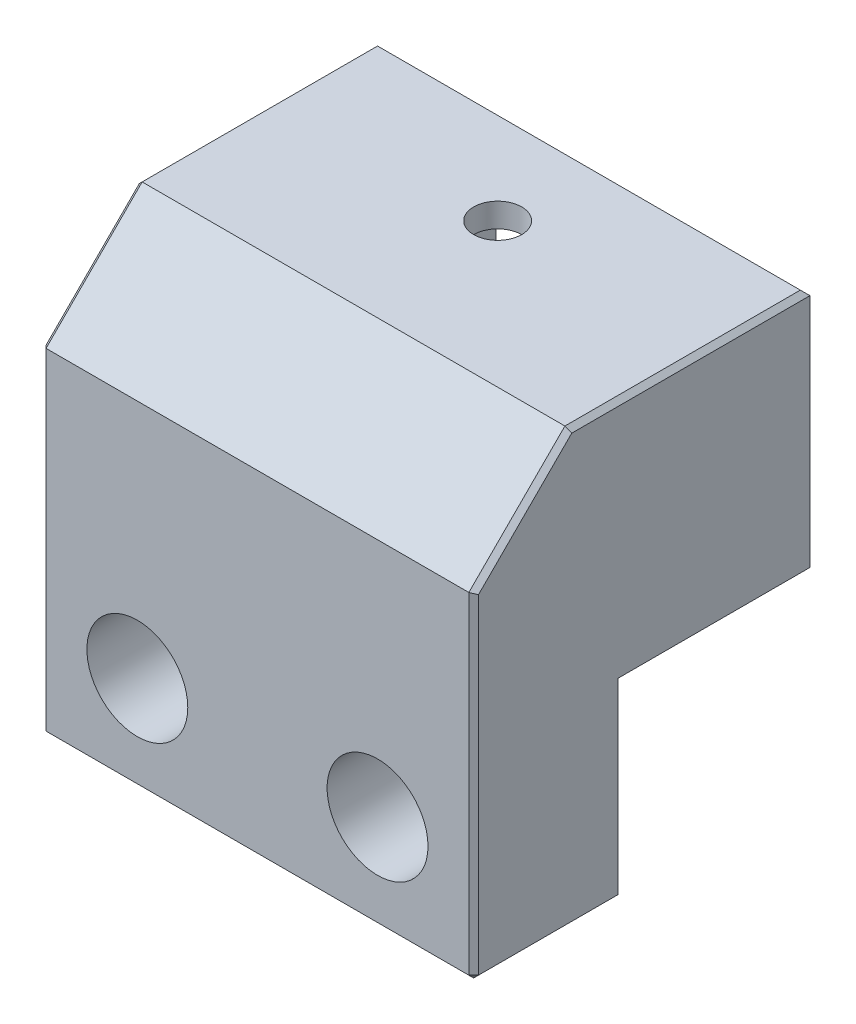
ISO-10303-21;
HEADER;
FILE_DESCRIPTION(('STEP AP214'),'2;1');
FILE_NAME('part.step','',(''),(''),'','','');
FILE_SCHEMA(('AUTOMOTIVE_DESIGN { 1 0 10303 214 1 1 1 1 }'));
ENDSEC;
DATA;
#1=APPLICATION_CONTEXT('core data for automotive mechanical design processes');
#2=APPLICATION_PROTOCOL_DEFINITION('international standard','automotive_design',2000,#1);
#3=PRODUCT_CONTEXT('',#1,'mechanical');
#4=PRODUCT('Part','Part','',(#3));
#5=PRODUCT_RELATED_PRODUCT_CATEGORY('part','',(#4));
#6=PRODUCT_DEFINITION_FORMATION('','',#4);
#7=PRODUCT_DEFINITION_CONTEXT('part definition',#1,'design');
#8=PRODUCT_DEFINITION('design','',#6,#7);
#9=PRODUCT_DEFINITION_SHAPE('','',#8);
#10=(LENGTH_UNIT() NAMED_UNIT(*) SI_UNIT(.MILLI.,.METRE.));
#11=(NAMED_UNIT(*) PLANE_ANGLE_UNIT() SI_UNIT($,.RADIAN.));
#12=(NAMED_UNIT(*) SI_UNIT($,.STERADIAN.) SOLID_ANGLE_UNIT());
#13=UNCERTAINTY_MEASURE_WITH_UNIT(LENGTH_MEASURE(1.E-05),#10,'distance_accuracy_value','');
#14=(GEOMETRIC_REPRESENTATION_CONTEXT(3) GLOBAL_UNCERTAINTY_ASSIGNED_CONTEXT((#13)) GLOBAL_UNIT_ASSIGNED_CONTEXT((#10,
#11,#12)) REPRESENTATION_CONTEXT('',''));
#15=CARTESIAN_POINT('',(0.,0.,0.));
#16=DIRECTION('',(0.,0.,1.));
#17=DIRECTION('',(1.,0.,0.));
#18=AXIS2_PLACEMENT_3D('',#15,#16,#17);
#19=CARTESIAN_POINT('',(0.,25.,0.));
#20=DIRECTION('',(0.,-1.,0.));
#21=DIRECTION('',(0.,0.,-1.));
#22=AXIS2_PLACEMENT_3D('',#19,#20,#21);
#23=CYLINDRICAL_SURFACE('',#22,2.5);
#24=CARTESIAN_POINT('',(0.,25.,0.));
#25=DIRECTION('',(0.,1.,0.));
#26=DIRECTION('',(0.,0.,1.));
#27=AXIS2_PLACEMENT_3D('',#24,#25,#26);
#28=CIRCLE('',#27,2.5);
#29=CARTESIAN_POINT('',(0.,25.,2.5));
#30=VERTEX_POINT('',#29);
#31=EDGE_CURVE('E210',#30,#30,#28,.T.);
#32=ORIENTED_EDGE('',*,*,#31,.T.);
#33=EDGE_LOOP('',(#32));
#34=FACE_BOUND('',#33,.T.);
#35=CARTESIAN_POINT('',(0.,22.5,0.));
#36=DIRECTION('',(0.,-1.,0.));
#37=DIRECTION('',(0.,0.,-1.));
#38=AXIS2_PLACEMENT_3D('',#35,#36,#37);
#39=CIRCLE('',#38,2.5);
#40=CARTESIAN_POINT('',(0.,22.5,-2.5));
#41=VERTEX_POINT('',#40);
#42=EDGE_CURVE('E195',#41,#41,#39,.T.);
#43=ORIENTED_EDGE('',*,*,#42,.T.);
#44=EDGE_LOOP('',(#43));
#45=FACE_BOUND('',#44,.T.);
#46=ADVANCED_FACE('F33',(#34,#45),#23,.F.);
#47=CARTESIAN_POINT('',(0.,25.,0.));
#48=DIRECTION('',(0.,1.,0.));
#49=DIRECTION('',(0.,0.,1.));
#50=AXIS2_PLACEMENT_3D('',#47,#48,#49);
#51=PLANE('',#50);
#52=DIRECTION('',(1.,0.,0.));
#53=VECTOR('',#52,1.);
#54=CARTESIAN_POINT('',(0.,25.,15.));
#55=LINE('',#54,#53);
#56=CARTESIAN_POINT('',(-22.,25.,15.));
#57=VERTEX_POINT('',#56);
#58=CARTESIAN_POINT('',(22.,25.,15.));
#59=VERTEX_POINT('',#58);
#60=EDGE_CURVE('E236',#57,#59,#55,.T.);
#61=ORIENTED_EDGE('',*,*,#60,.T.);
#62=DIRECTION('',(0.,0.,-1.));
#63=VECTOR('',#62,1.);
#64=CARTESIAN_POINT('',(22.,25.,-10.));
#65=LINE('',#64,#63);
#66=CARTESIAN_POINT('',(22.,25.,-9.50000000000001));
#67=VERTEX_POINT('',#66);
#68=EDGE_CURVE('E282',#59,#67,#65,.T.);
#69=ORIENTED_EDGE('',*,*,#68,.T.);
#70=DIRECTION('',(-1.,0.,0.));
#71=VECTOR('',#70,1.);
#72=CARTESIAN_POINT('',(-22.5,25.,-9.50000000000001));
#73=LINE('',#72,#71);
#74=CARTESIAN_POINT('',(-22.,25.,-9.50000000000001));
#75=VERTEX_POINT('',#74);
#76=EDGE_CURVE('E280',#67,#75,#73,.T.);
#77=ORIENTED_EDGE('',*,*,#76,.T.);
#78=DIRECTION('',(0.,0.,1.));
#79=VECTOR('',#78,1.);
#80=CARTESIAN_POINT('',(-22.,25.,15.));
#81=LINE('',#80,#79);
#82=EDGE_CURVE('E278',#75,#57,#81,.T.);
#83=ORIENTED_EDGE('',*,*,#82,.T.);
#84=EDGE_LOOP('',(#61,#69,#77,#83));
#85=FACE_BOUND('',#84,.T.);
#86=ORIENTED_EDGE('',*,*,#31,.F.);
#87=EDGE_LOOP('',(#86));
#88=FACE_BOUND('',#87,.T.);
#89=ADVANCED_FACE('F363',(#85,#88),#51,.T.);
#90=CARTESIAN_POINT('',(0.,0.,0.));
#91=DIRECTION('',(0.,1.,0.));
#92=DIRECTION('',(0.,0.,1.));
#93=AXIS2_PLACEMENT_3D('',#90,#91,#92);
#94=PLANE('',#93);
#95=DIRECTION('',(0.,0.,-1.));
#96=VECTOR('',#95,1.);
#97=CARTESIAN_POINT('',(22.5,0.,-10.));
#98=LINE('',#97,#96);
#99=CARTESIAN_POINT('',(22.5,0.,10.));
#100=VERTEX_POINT('',#99);
#101=CARTESIAN_POINT('',(22.5,0.,-10.));
#102=VERTEX_POINT('',#101);
#103=EDGE_CURVE('E213',#100,#102,#98,.T.);
#104=ORIENTED_EDGE('',*,*,#103,.F.);
#105=DIRECTION('',(1.,0.,0.));
#106=VECTOR('',#105,1.);
#107=CARTESIAN_POINT('',(-22.5,0.,10.));
#108=LINE('',#107,#106);
#109=CARTESIAN_POINT('',(-22.5,0.,10.));
#110=VERTEX_POINT('',#109);
#111=EDGE_CURVE('E223',#110,#100,#108,.T.);
#112=ORIENTED_EDGE('',*,*,#111,.F.);
#113=DIRECTION('',(0.,0.,1.));
#114=VECTOR('',#113,1.);
#115=CARTESIAN_POINT('',(-22.5,0.,-10.));
#116=LINE('',#115,#114);
#117=CARTESIAN_POINT('',(-22.5,0.,-10.));
#118=VERTEX_POINT('',#117);
#119=EDGE_CURVE('E221',#118,#110,#116,.T.);
#120=ORIENTED_EDGE('',*,*,#119,.F.);
#121=DIRECTION('',(-1.,0.,0.));
#122=VECTOR('',#121,1.);
#123=CARTESIAN_POINT('',(-22.5,0.,-10.));
#124=LINE('',#123,#122);
#125=EDGE_CURVE('E218',#102,#118,#124,.T.);
#126=ORIENTED_EDGE('',*,*,#125,.F.);
#127=EDGE_LOOP('',(#104,#112,#120,#126));
#128=FACE_BOUND('',#127,.T.);
#129=CARTESIAN_POINT('',(0.,0.,0.));
#130=DIRECTION('',(0.,1.,0.));
#131=DIRECTION('',(0.,0.,1.));
#132=AXIS2_PLACEMENT_3D('',#129,#130,#131);
#133=CIRCLE('',#132,2.5);
#134=CARTESIAN_POINT('',(0.,0.,2.5));
#135=VERTEX_POINT('',#134);
#136=EDGE_CURVE('E209',#135,#135,#133,.T.);
#137=ORIENTED_EDGE('',*,*,#136,.T.);
#138=EDGE_LOOP('',(#137));
#139=FACE_BOUND('',#138,.T.);
#140=ADVANCED_FACE('F370',(#128,#139),#94,.F.);
#141=CARTESIAN_POINT('',(22.5,25.,-10.));
#142=DIRECTION('',(-1.,0.,0.));
#143=DIRECTION('',(0.,0.,1.));
#144=AXIS2_PLACEMENT_3D('',#141,#142,#143);
#145=PLANE('',#144);
#146=DIRECTION('',(0.,-1.,0.));
#147=VECTOR('',#146,1.);
#148=CARTESIAN_POINT('',(22.5,25.,-10.));
#149=LINE('',#148,#147);
#150=CARTESIAN_POINT('',(22.5,24.5,-10.));
#151=VERTEX_POINT('',#150);
#152=EDGE_CURVE('E228',#151,#102,#149,.T.);
#153=ORIENTED_EDGE('',*,*,#152,.F.);
#154=DIRECTION('',(0.,0.,1.));
#155=VECTOR('',#154,1.);
#156=CARTESIAN_POINT('',(22.5,24.5,15.));
#157=LINE('',#156,#155);
#158=CARTESIAN_POINT('',(22.5,24.5,14.7928932188134));
#159=VERTEX_POINT('',#158);
#160=EDGE_CURVE('E253',#151,#159,#157,.T.);
#161=ORIENTED_EDGE('',*,*,#160,.T.);
#162=DIRECTION('',(0.,-0.707106781186546,0.707106781186549));
#163=VECTOR('',#162,1.);
#164=CARTESIAN_POINT('',(22.5,14.6464466094067,24.6464466094067));
#165=LINE('',#164,#163);
#166=CARTESIAN_POINT('',(22.5,14.7928932188135,24.5));
#167=VERTEX_POINT('',#166);
#168=EDGE_CURVE('E248',#159,#167,#165,.T.);
#169=ORIENTED_EDGE('',*,*,#168,.T.);
#170=DIRECTION('',(0.,-1.,0.));
#171=VECTOR('',#170,1.);
#172=CARTESIAN_POINT('',(22.5,-20.,24.5));
#173=LINE('',#172,#171);
#174=CARTESIAN_POINT('',(22.5,-19.5,24.5));
#175=VERTEX_POINT('',#174);
#176=EDGE_CURVE('E239',#167,#175,#173,.T.);
#177=ORIENTED_EDGE('',*,*,#176,.T.);
#178=DIRECTION('',(0.,0.,-1.));
#179=VECTOR('',#178,1.);
#180=CARTESIAN_POINT('',(22.5,-19.5,-10.));
#181=LINE('',#180,#179);
#182=CARTESIAN_POINT('',(22.5,-19.5,10.));
#183=VERTEX_POINT('',#182);
#184=EDGE_CURVE('E250',#175,#183,#181,.T.);
#185=ORIENTED_EDGE('',*,*,#184,.T.);
#186=DIRECTION('',(0.,1.,0.));
#187=VECTOR('',#186,1.);
#188=CARTESIAN_POINT('',(22.5,25.,10.));
#189=LINE('',#188,#187);
#190=EDGE_CURVE('E207',#183,#100,#189,.T.);
#191=ORIENTED_EDGE('',*,*,#190,.T.);
#192=ORIENTED_EDGE('',*,*,#103,.T.);
#193=EDGE_LOOP('',(#153,#161,#169,#177,#185,#191,#192));
#194=FACE_BOUND('',#193,.T.);
#195=ADVANCED_FACE('F394',(#194),#145,.F.);
#196=CARTESIAN_POINT('',(-22.5,25.,-10.));
#197=DIRECTION('',(0.,0.,1.));
#198=DIRECTION('',(1.,0.,0.));
#199=AXIS2_PLACEMENT_3D('',#196,#197,#198);
#200=PLANE('',#199);
#201=DIRECTION('',(0.,1.,0.));
#202=VECTOR('',#201,1.);
#203=CARTESIAN_POINT('',(-10.16,3.,-10.));
#204=LINE('',#203,#202);
#205=CARTESIAN_POINT('',(-10.16,3.,-10.));
#206=VERTEX_POINT('',#205);
#207=CARTESIAN_POINT('',(-10.16,22.5,-10.));
#208=VERTEX_POINT('',#207);
#209=EDGE_CURVE('E196',#206,#208,#204,.T.);
#210=ORIENTED_EDGE('',*,*,#209,.F.);
#211=DIRECTION('',(-1.,0.,0.));
#212=VECTOR('',#211,1.);
#213=CARTESIAN_POINT('',(10.16,3.,-10.));
#214=LINE('',#213,#212);
#215=CARTESIAN_POINT('',(10.16,3.,-10.));
#216=VERTEX_POINT('',#215);
#217=EDGE_CURVE('E172',#216,#206,#214,.T.);
#218=ORIENTED_EDGE('',*,*,#217,.F.);
#219=DIRECTION('',(0.,1.,0.));
#220=VECTOR('',#219,1.);
#221=CARTESIAN_POINT('',(10.16,3.,-10.));
#222=LINE('',#221,#220);
#223=CARTESIAN_POINT('',(10.16,22.5,-10.));
#224=VERTEX_POINT('',#223);
#225=EDGE_CURVE('E163',#216,#224,#222,.T.);
#226=ORIENTED_EDGE('',*,*,#225,.T.);
#227=DIRECTION('',(-1.,0.,0.));
#228=VECTOR('',#227,1.);
#229=CARTESIAN_POINT('',(10.16,22.5,-10.));
#230=LINE('',#229,#228);
#231=EDGE_CURVE('E179',#224,#208,#230,.T.);
#232=ORIENTED_EDGE('',*,*,#231,.T.);
#233=EDGE_LOOP('',(#210,#218,#226,#232));
#234=FACE_BOUND('',#233,.T.);
#235=DIRECTION('',(0.,-1.,0.));
#236=VECTOR('',#235,1.);
#237=CARTESIAN_POINT('',(-22.5,25.,-10.));
#238=LINE('',#237,#236);
#239=CARTESIAN_POINT('',(-22.5,24.5,-10.));
#240=VERTEX_POINT('',#239);
#241=EDGE_CURVE('E226',#240,#118,#238,.T.);
#242=ORIENTED_EDGE('',*,*,#241,.F.);
#243=DIRECTION('',(1.,0.,0.));
#244=VECTOR('',#243,1.);
#245=CARTESIAN_POINT('',(22.5,24.5,-10.));
#246=LINE('',#245,#244);
#247=EDGE_CURVE('E284',#240,#151,#246,.T.);
#248=ORIENTED_EDGE('',*,*,#247,.T.);
#249=ORIENTED_EDGE('',*,*,#152,.T.);
#250=ORIENTED_EDGE('',*,*,#125,.T.);
#251=EDGE_LOOP('',(#242,#248,#249,#250));
#252=FACE_BOUND('',#251,.T.);
#253=ADVANCED_FACE('F386',(#234,#252),#200,.F.);
#254=CARTESIAN_POINT('',(-22.5,25.,-10.));
#255=DIRECTION('',(1.,0.,0.));
#256=DIRECTION('',(0.,0.,-1.));
#257=AXIS2_PLACEMENT_3D('',#254,#255,#256);
#258=PLANE('',#257);
#259=DIRECTION('',(0.,-1.,0.));
#260=VECTOR('',#259,1.);
#261=CARTESIAN_POINT('',(-22.5,25.,10.));
#262=LINE('',#261,#260);
#263=CARTESIAN_POINT('',(-22.5,-19.5,10.));
#264=VERTEX_POINT('',#263);
#265=EDGE_CURVE('E200',#110,#264,#262,.T.);
#266=ORIENTED_EDGE('',*,*,#265,.T.);
#267=DIRECTION('',(0.,0.,1.));
#268=VECTOR('',#267,1.);
#269=CARTESIAN_POINT('',(-22.5,-19.5,-10.));
#270=LINE('',#269,#268);
#271=CARTESIAN_POINT('',(-22.5,-19.5,24.5));
#272=VERTEX_POINT('',#271);
#273=EDGE_CURVE('E271',#264,#272,#270,.T.);
#274=ORIENTED_EDGE('',*,*,#273,.T.);
#275=DIRECTION('',(0.,1.,0.));
#276=VECTOR('',#275,1.);
#277=CARTESIAN_POINT('',(-22.5,15.,24.5));
#278=LINE('',#277,#276);
#279=CARTESIAN_POINT('',(-22.5,14.7928932188134,24.5));
#280=VERTEX_POINT('',#279);
#281=EDGE_CURVE('E265',#272,#280,#278,.T.);
#282=ORIENTED_EDGE('',*,*,#281,.T.);
#283=DIRECTION('',(0.,0.707106781186546,-0.707106781186549));
#284=VECTOR('',#283,1.);
#285=CARTESIAN_POINT('',(-22.5,24.6464466094067,14.6464466094067));
#286=LINE('',#285,#284);
#287=CARTESIAN_POINT('',(-22.5,24.5,14.7928932188134));
#288=VERTEX_POINT('',#287);
#289=EDGE_CURVE('E267',#280,#288,#286,.T.);
#290=ORIENTED_EDGE('',*,*,#289,.T.);
#291=DIRECTION('',(0.,0.,-1.));
#292=VECTOR('',#291,1.);
#293=CARTESIAN_POINT('',(-22.5,24.5,-10.));
#294=LINE('',#293,#292);
#295=EDGE_CURVE('E269',#288,#240,#294,.T.);
#296=ORIENTED_EDGE('',*,*,#295,.T.);
#297=ORIENTED_EDGE('',*,*,#241,.T.);
#298=ORIENTED_EDGE('',*,*,#119,.T.);
#299=EDGE_LOOP('',(#266,#274,#282,#290,#296,#297,#298));
#300=FACE_BOUND('',#299,.T.);
#301=ADVANCED_FACE('F377',(#300),#258,.F.);
#302=CARTESIAN_POINT('',(0.,3.,0.));
#303=DIRECTION('',(0.,-1.,0.));
#304=DIRECTION('',(0.,0.,-1.));
#305=AXIS2_PLACEMENT_3D('',#302,#303,#304);
#306=CIRCLE('',#305,2.5);
#307=CARTESIAN_POINT('',(0.,3.,-2.5));
#308=VERTEX_POINT('',#307);
#309=EDGE_CURVE('E204',#308,#308,#306,.T.);
#310=ORIENTED_EDGE('',*,*,#309,.F.);
#311=EDGE_LOOP('',(#310));
#312=FACE_BOUND('',#311,.T.);
#313=ORIENTED_EDGE('',*,*,#136,.F.);
#314=EDGE_LOOP('',(#313));
#315=FACE_BOUND('',#314,.T.);
#316=ADVANCED_FACE('F366',(#312,#315),#23,.F.);
#317=CARTESIAN_POINT('',(0.,0.,10.));
#318=DIRECTION('',(0.,0.,1.));
#319=DIRECTION('',(1.,0.,0.));
#320=AXIS2_PLACEMENT_3D('',#317,#318,#319);
#321=PLANE('',#320);
#322=CARTESIAN_POINT('',(-12.5,-10.,10.));
#323=DIRECTION('',(0.,0.,1.));
#324=DIRECTION('',(1.,0.,0.));
#325=AXIS2_PLACEMENT_3D('',#322,#323,#324);
#326=CIRCLE('',#325,2.74999999999999);
#327=CARTESIAN_POINT('',(-9.75000000000001,-10.,10.));
#328=VERTEX_POINT('',#327);
#329=EDGE_CURVE('E242',#328,#328,#326,.T.);
#330=ORIENTED_EDGE('',*,*,#329,.T.);
#331=EDGE_LOOP('',(#330));
#332=FACE_BOUND('',#331,.T.);
#333=CARTESIAN_POINT('',(12.5,-10.,10.));
#334=DIRECTION('',(0.,0.,1.));
#335=DIRECTION('',(1.,0.,0.));
#336=AXIS2_PLACEMENT_3D('',#333,#334,#335);
#337=CIRCLE('',#336,2.74999999999999);
#338=CARTESIAN_POINT('',(15.25,-10.,10.));
#339=VERTEX_POINT('',#338);
#340=EDGE_CURVE('E189',#339,#339,#337,.T.);
#341=ORIENTED_EDGE('',*,*,#340,.T.);
#342=EDGE_LOOP('',(#341));
#343=FACE_BOUND('',#342,.T.);
#344=ORIENTED_EDGE('',*,*,#190,.F.);
#345=DIRECTION('',(0.707106781186556,0.707106781186539,0.));
#346=VECTOR('',#345,1.);
#347=CARTESIAN_POINT('',(22.5,-19.5,10.));
#348=LINE('',#347,#346);
#349=CARTESIAN_POINT('',(22.,-20.,10.));
#350=VERTEX_POINT('',#349);
#351=EDGE_CURVE('E257',#183,#350,#348,.F.);
#352=ORIENTED_EDGE('',*,*,#351,.T.);
#353=DIRECTION('',(1.,0.,0.));
#354=VECTOR('',#353,1.);
#355=CARTESIAN_POINT('',(-22.5,-20.,10.));
#356=LINE('',#355,#354);
#357=CARTESIAN_POINT('',(-22.,-20.,10.));
#358=VERTEX_POINT('',#357);
#359=EDGE_CURVE('E203',#358,#350,#356,.T.);
#360=ORIENTED_EDGE('',*,*,#359,.F.);
#361=DIRECTION('',(0.70710678118654,-0.707106781186555,0.));
#362=VECTOR('',#361,1.);
#363=CARTESIAN_POINT('',(-22.,-20.,10.));
#364=LINE('',#363,#362);
#365=EDGE_CURVE('E255',#358,#264,#364,.F.);
#366=ORIENTED_EDGE('',*,*,#365,.T.);
#367=ORIENTED_EDGE('',*,*,#265,.F.);
#368=ORIENTED_EDGE('',*,*,#111,.T.);
#369=EDGE_LOOP('',(#344,#352,#360,#366,#367,#368));
#370=FACE_BOUND('',#369,.T.);
#371=ADVANCED_FACE('F376',(#332,#343,#370),#321,.F.);
#372=CARTESIAN_POINT('',(-22.5,-20.,25.));
#373=DIRECTION('',(0.,1.,0.));
#374=DIRECTION('',(-1.,0.,0.));
#375=AXIS2_PLACEMENT_3D('',#372,#373,#374);
#376=PLANE('',#375);
#377=ORIENTED_EDGE('',*,*,#359,.T.);
#378=DIRECTION('',(0.,0.,1.));
#379=VECTOR('',#378,1.);
#380=CARTESIAN_POINT('',(22.,-20.,25.));
#381=LINE('',#380,#379);
#382=CARTESIAN_POINT('',(22.,-20.,24.5));
#383=VERTEX_POINT('',#382);
#384=EDGE_CURVE('E263',#350,#383,#381,.T.);
#385=ORIENTED_EDGE('',*,*,#384,.T.);
#386=DIRECTION('',(-1.,0.,0.));
#387=VECTOR('',#386,1.);
#388=CARTESIAN_POINT('',(-22.5,-20.,24.5));
#389=LINE('',#388,#387);
#390=CARTESIAN_POINT('',(-22.,-20.,24.5));
#391=VERTEX_POINT('',#390);
#392=EDGE_CURVE('E259',#383,#391,#389,.T.);
#393=ORIENTED_EDGE('',*,*,#392,.T.);
#394=DIRECTION('',(0.,0.,-1.));
#395=VECTOR('',#394,1.);
#396=CARTESIAN_POINT('',(-22.,-20.,25.));
#397=LINE('',#396,#395);
#398=EDGE_CURVE('E261',#391,#358,#397,.T.);
#399=ORIENTED_EDGE('',*,*,#398,.T.);
#400=EDGE_LOOP('',(#377,#385,#393,#399));
#401=FACE_BOUND('',#400,.T.);
#402=ADVANCED_FACE('F383',(#401),#376,.F.);
#403=CARTESIAN_POINT('',(0.,0.,25.));
#404=DIRECTION('',(0.,0.,1.));
#405=DIRECTION('',(1.,0.,0.));
#406=AXIS2_PLACEMENT_3D('',#403,#404,#405);
#407=PLANE('',#406);
#408=CARTESIAN_POINT('',(-12.5,-10.,25.));
#409=DIRECTION('',(0.,0.,1.));
#410=DIRECTION('',(1.,0.,0.));
#411=AXIS2_PLACEMENT_3D('',#408,#409,#410);
#412=CIRCLE('',#411,5.25);
#413=CARTESIAN_POINT('',(-7.25,-10.,25.));
#414=VERTEX_POINT('',#413);
#415=EDGE_CURVE('E323',#414,#414,#412,.T.);
#416=ORIENTED_EDGE('',*,*,#415,.F.);
#417=EDGE_LOOP('',(#416));
#418=FACE_BOUND('',#417,.T.);
#419=CARTESIAN_POINT('',(12.5,-10.,25.));
#420=DIRECTION('',(0.,0.,1.));
#421=DIRECTION('',(1.,0.,0.));
#422=AXIS2_PLACEMENT_3D('',#419,#420,#421);
#423=CIRCLE('',#422,5.25);
#424=CARTESIAN_POINT('',(17.75,-10.,25.));
#425=VERTEX_POINT('',#424);
#426=EDGE_CURVE('E245',#425,#425,#423,.T.);
#427=ORIENTED_EDGE('',*,*,#426,.F.);
#428=EDGE_LOOP('',(#427));
#429=FACE_BOUND('',#428,.T.);
#430=DIRECTION('',(1.,0.,0.));
#431=VECTOR('',#430,1.);
#432=CARTESIAN_POINT('',(22.5,-19.5,25.));
#433=LINE('',#432,#431);
#434=CARTESIAN_POINT('',(-22.,-19.5,25.));
#435=VERTEX_POINT('',#434);
#436=CARTESIAN_POINT('',(22.,-19.5,25.));
#437=VERTEX_POINT('',#436);
#438=EDGE_CURVE('E42',#435,#437,#433,.T.);
#439=ORIENTED_EDGE('',*,*,#438,.T.);
#440=DIRECTION('',(0.,1.,0.));
#441=VECTOR('',#440,1.);
#442=CARTESIAN_POINT('',(22.,15.,25.));
#443=LINE('',#442,#441);
#444=CARTESIAN_POINT('',(22.,15.,25.));
#445=VERTEX_POINT('',#444);
#446=EDGE_CURVE('E11',#437,#445,#443,.T.);
#447=ORIENTED_EDGE('',*,*,#446,.T.);
#448=DIRECTION('',(-1.,0.,0.));
#449=VECTOR('',#448,1.);
#450=CARTESIAN_POINT('',(0.,15.,25.));
#451=LINE('',#450,#449);
#452=CARTESIAN_POINT('',(-22.,15.,25.));
#453=VERTEX_POINT('',#452);
#454=EDGE_CURVE('E230',#445,#453,#451,.T.);
#455=ORIENTED_EDGE('',*,*,#454,.T.);
#456=DIRECTION('',(0.,-1.,0.));
#457=VECTOR('',#456,1.);
#458=CARTESIAN_POINT('',(-22.,-20.,25.));
#459=LINE('',#458,#457);
#460=EDGE_CURVE('E53',#453,#435,#459,.T.);
#461=ORIENTED_EDGE('',*,*,#460,.T.);
#462=EDGE_LOOP('',(#439,#447,#455,#461));
#463=FACE_BOUND('',#462,.T.);
#464=ADVANCED_FACE('F487',(#418,#429,#463),#407,.T.);
#465=CARTESIAN_POINT('',(0.,3.,0.));
#466=DIRECTION('',(0.,1.,0.));
#467=DIRECTION('',(0.,0.,1.));
#468=AXIS2_PLACEMENT_3D('',#465,#466,#467);
#469=CYLINDRICAL_SURFACE('',#468,10.16);
#470=CARTESIAN_POINT('',(0.,22.5,0.));
#471=DIRECTION('',(0.,1.,0.));
#472=DIRECTION('',(0.,0.,-1.));
#473=AXIS2_PLACEMENT_3D('',#470,#471,#472);
#474=CIRCLE('',#473,10.16);
#475=CARTESIAN_POINT('',(-10.16,22.5,0.));
#476=VERTEX_POINT('',#475);
#477=CARTESIAN_POINT('',(10.16,22.5,0.));
#478=VERTEX_POINT('',#477);
#479=EDGE_CURVE('E159',#476,#478,#474,.T.);
#480=ORIENTED_EDGE('',*,*,#479,.T.);
#481=DIRECTION('',(0.,1.,0.));
#482=VECTOR('',#481,1.);
#483=CARTESIAN_POINT('',(10.16,3.,0.));
#484=LINE('',#483,#482);
#485=CARTESIAN_POINT('',(10.16,3.,0.));
#486=VERTEX_POINT('',#485);
#487=EDGE_CURVE('E152',#486,#478,#484,.T.);
#488=ORIENTED_EDGE('',*,*,#487,.F.);
#489=CARTESIAN_POINT('',(0.,3.,0.));
#490=DIRECTION('',(0.,1.,0.));
#491=DIRECTION('',(0.,0.,-1.));
#492=AXIS2_PLACEMENT_3D('',#489,#490,#491);
#493=CIRCLE('',#492,10.16);
#494=CARTESIAN_POINT('',(-10.16,3.,0.));
#495=VERTEX_POINT('',#494);
#496=EDGE_CURVE('E156',#495,#486,#493,.T.);
#497=ORIENTED_EDGE('',*,*,#496,.F.);
#498=DIRECTION('',(0.,1.,0.));
#499=VECTOR('',#498,1.);
#500=CARTESIAN_POINT('',(-10.16,3.,0.));
#501=LINE('',#500,#499);
#502=EDGE_CURVE('E193',#495,#476,#501,.T.);
#503=ORIENTED_EDGE('',*,*,#502,.T.);
#504=EDGE_LOOP('',(#480,#488,#497,#503));
#505=FACE_BOUND('',#504,.T.);
#506=ADVANCED_FACE('F154',(#505),#469,.F.);
#507=CARTESIAN_POINT('',(-10.16,3.,-10.));
#508=DIRECTION('',(-1.,0.,0.));
#509=DIRECTION('',(0.,0.,1.));
#510=AXIS2_PLACEMENT_3D('',#507,#508,#509);
#511=PLANE('',#510);
#512=DIRECTION('',(0.,0.,1.));
#513=VECTOR('',#512,1.);
#514=CARTESIAN_POINT('',(-10.16,22.5,-10.));
#515=LINE('',#514,#513);
#516=EDGE_CURVE('E176',#208,#476,#515,.T.);
#517=ORIENTED_EDGE('',*,*,#516,.T.);
#518=ORIENTED_EDGE('',*,*,#502,.F.);
#519=DIRECTION('',(0.,0.,1.));
#520=VECTOR('',#519,1.);
#521=CARTESIAN_POINT('',(-10.16,3.,-10.));
#522=LINE('',#521,#520);
#523=EDGE_CURVE('E164',#206,#495,#522,.T.);
#524=ORIENTED_EDGE('',*,*,#523,.F.);
#525=ORIENTED_EDGE('',*,*,#209,.T.);
#526=EDGE_LOOP('',(#517,#518,#524,#525));
#527=FACE_BOUND('',#526,.T.);
#528=ADVANCED_FACE('F510',(#527),#511,.F.);
#529=CARTESIAN_POINT('',(10.16,3.,0.));
#530=DIRECTION('',(1.,0.,0.));
#531=DIRECTION('',(0.,0.,-1.));
#532=AXIS2_PLACEMENT_3D('',#529,#530,#531);
#533=PLANE('',#532);
#534=DIRECTION('',(0.,0.,-1.));
#535=VECTOR('',#534,1.);
#536=CARTESIAN_POINT('',(10.16,22.5,0.));
#537=LINE('',#536,#535);
#538=EDGE_CURVE('E188',#478,#224,#537,.T.);
#539=ORIENTED_EDGE('',*,*,#538,.T.);
#540=ORIENTED_EDGE('',*,*,#225,.F.);
#541=DIRECTION('',(0.,0.,-1.));
#542=VECTOR('',#541,1.);
#543=CARTESIAN_POINT('',(10.16,3.,0.));
#544=LINE('',#543,#542);
#545=EDGE_CURVE('E167',#486,#216,#544,.T.);
#546=ORIENTED_EDGE('',*,*,#545,.F.);
#547=ORIENTED_EDGE('',*,*,#487,.T.);
#548=EDGE_LOOP('',(#539,#540,#546,#547));
#549=FACE_BOUND('',#548,.T.);
#550=ADVANCED_FACE('F168',(#549),#533,.F.);
#551=CARTESIAN_POINT('',(0.,3.,0.));
#552=DIRECTION('',(0.,-1.,0.));
#553=DIRECTION('',(0.,0.,-1.));
#554=AXIS2_PLACEMENT_3D('',#551,#552,#553);
#555=PLANE('',#554);
#556=ORIENTED_EDGE('',*,*,#309,.T.);
#557=EDGE_LOOP('',(#556));
#558=FACE_BOUND('',#557,.T.);
#559=ORIENTED_EDGE('',*,*,#496,.T.);
#560=ORIENTED_EDGE('',*,*,#545,.T.);
#561=ORIENTED_EDGE('',*,*,#217,.T.);
#562=ORIENTED_EDGE('',*,*,#523,.T.);
#563=EDGE_LOOP('',(#559,#560,#561,#562));
#564=FACE_BOUND('',#563,.T.);
#565=ADVANCED_FACE('F174',(#558,#564),#555,.F.);
#566=CARTESIAN_POINT('',(0.,22.5,0.));
#567=DIRECTION('',(0.,-1.,0.));
#568=DIRECTION('',(0.,0.,-1.));
#569=AXIS2_PLACEMENT_3D('',#566,#567,#568);
#570=PLANE('',#569);
#571=ORIENTED_EDGE('',*,*,#42,.F.);
#572=EDGE_LOOP('',(#571));
#573=FACE_BOUND('',#572,.T.);
#574=ORIENTED_EDGE('',*,*,#479,.F.);
#575=ORIENTED_EDGE('',*,*,#516,.F.);
#576=ORIENTED_EDGE('',*,*,#231,.F.);
#577=ORIENTED_EDGE('',*,*,#538,.F.);
#578=EDGE_LOOP('',(#574,#575,#576,#577));
#579=FACE_BOUND('',#578,.T.);
#580=ADVANCED_FACE('F409',(#573,#579),#570,.T.);
#581=CARTESIAN_POINT('',(0.,15.,25.));
#582=DIRECTION('',(0.,-0.707106781186549,-0.707106781186546));
#583=DIRECTION('',(-1.,0.,0.));
#584=AXIS2_PLACEMENT_3D('',#581,#582,#583);
#585=PLANE('',#584);
#586=ORIENTED_EDGE('',*,*,#454,.F.);
#587=DIRECTION('',(0.,-0.707106781186546,0.707106781186549));
#588=VECTOR('',#587,1.);
#589=CARTESIAN_POINT('',(22.,25.,15.));
#590=LINE('',#589,#588);
#591=EDGE_CURVE('E275',#445,#59,#590,.F.);
#592=ORIENTED_EDGE('',*,*,#591,.T.);
#593=ORIENTED_EDGE('',*,*,#60,.F.);
#594=DIRECTION('',(0.,0.707106781186546,-0.707106781186549));
#595=VECTOR('',#594,1.);
#596=CARTESIAN_POINT('',(-22.,15.,25.));
#597=LINE('',#596,#595);
#598=EDGE_CURVE('E273',#57,#453,#597,.F.);
#599=ORIENTED_EDGE('',*,*,#598,.T.);
#600=EDGE_LOOP('',(#586,#592,#593,#599));
#601=FACE_BOUND('',#600,.T.);
#602=ADVANCED_FACE('F360',(#601),#585,.F.);
#603=CARTESIAN_POINT('',(12.5,-10.,25.));
#604=DIRECTION('',(0.,0.,1.));
#605=DIRECTION('',(1.,0.,0.));
#606=AXIS2_PLACEMENT_3D('',#603,#604,#605);
#607=CYLINDRICAL_SURFACE('',#606,2.74999999999999);
#608=CARTESIAN_POINT('',(12.5,-10.,15.25));
#609=DIRECTION('',(0.,0.,1.));
#610=DIRECTION('',(1.,0.,0.));
#611=AXIS2_PLACEMENT_3D('',#608,#609,#610);
#612=CIRCLE('',#611,2.75);
#613=CARTESIAN_POINT('',(15.25,-10.,15.25));
#614=VERTEX_POINT('',#613);
#615=EDGE_CURVE('E182',#614,#614,#612,.T.);
#616=ORIENTED_EDGE('',*,*,#615,.T.);
#617=EDGE_LOOP('',(#616));
#618=FACE_BOUND('',#617,.T.);
#619=ORIENTED_EDGE('',*,*,#340,.F.);
#620=EDGE_LOOP('',(#619));
#621=FACE_BOUND('',#620,.T.);
#622=ADVANCED_FACE('F346',(#618,#621),#607,.F.);
#623=CARTESIAN_POINT('',(15.25,-10.,15.25));
#624=DIRECTION('',(0.,0.,-1.));
#625=DIRECTION('',(-1.,0.,0.));
#626=AXIS2_PLACEMENT_3D('',#623,#624,#625);
#627=PLANE('',#626);
#628=ORIENTED_EDGE('',*,*,#615,.F.);
#629=EDGE_LOOP('',(#628));
#630=FACE_BOUND('',#629,.T.);
#631=CARTESIAN_POINT('',(12.5,-10.,15.25));
#632=DIRECTION('',(0.,0.,1.));
#633=DIRECTION('',(1.,0.,0.));
#634=AXIS2_PLACEMENT_3D('',#631,#632,#633);
#635=CIRCLE('',#634,5.25);
#636=CARTESIAN_POINT('',(17.75,-10.,15.25));
#637=VERTEX_POINT('',#636);
#638=EDGE_CURVE('E339',#637,#637,#635,.T.);
#639=ORIENTED_EDGE('',*,*,#638,.T.);
#640=EDGE_LOOP('',(#639));
#641=FACE_BOUND('',#640,.T.);
#642=ADVANCED_FACE('F349',(#630,#641),#627,.F.);
#643=CARTESIAN_POINT('',(12.5,-10.,25.));
#644=DIRECTION('',(0.,0.,1.));
#645=DIRECTION('',(1.,0.,0.));
#646=AXIS2_PLACEMENT_3D('',#643,#644,#645);
#647=CYLINDRICAL_SURFACE('',#646,5.25);
#648=ORIENTED_EDGE('',*,*,#638,.F.);
#649=EDGE_LOOP('',(#648));
#650=FACE_BOUND('',#649,.T.);
#651=ORIENTED_EDGE('',*,*,#426,.T.);
#652=EDGE_LOOP('',(#651));
#653=FACE_BOUND('',#652,.T.);
#654=ADVANCED_FACE('F351',(#650,#653),#647,.F.);
#655=CARTESIAN_POINT('',(-12.5,-10.,25.));
#656=DIRECTION('',(0.,0.,1.));
#657=DIRECTION('',(1.,0.,0.));
#658=AXIS2_PLACEMENT_3D('',#655,#656,#657);
#659=CYLINDRICAL_SURFACE('',#658,2.74999999999999);
#660=CARTESIAN_POINT('',(-12.5,-10.,15.25));
#661=DIRECTION('',(0.,0.,1.));
#662=DIRECTION('',(1.,0.,0.));
#663=AXIS2_PLACEMENT_3D('',#660,#661,#662);
#664=CIRCLE('',#663,2.75);
#665=CARTESIAN_POINT('',(-9.75,-10.,15.25));
#666=VERTEX_POINT('',#665);
#667=EDGE_CURVE('E246',#666,#666,#664,.T.);
#668=ORIENTED_EDGE('',*,*,#667,.T.);
#669=EDGE_LOOP('',(#668));
#670=FACE_BOUND('',#669,.T.);
#671=ORIENTED_EDGE('',*,*,#329,.F.);
#672=EDGE_LOOP('',(#671));
#673=FACE_BOUND('',#672,.T.);
#674=ADVANCED_FACE('F357',(#670,#673),#659,.F.);
#675=CARTESIAN_POINT('',(-9.75,-10.,15.25));
#676=DIRECTION('',(0.,0.,-1.));
#677=DIRECTION('',(-1.,0.,0.));
#678=AXIS2_PLACEMENT_3D('',#675,#676,#677);
#679=PLANE('',#678);
#680=ORIENTED_EDGE('',*,*,#667,.F.);
#681=EDGE_LOOP('',(#680));
#682=FACE_BOUND('',#681,.T.);
#683=CARTESIAN_POINT('',(-12.5,-10.,15.25));
#684=DIRECTION('',(0.,0.,1.));
#685=DIRECTION('',(1.,0.,0.));
#686=AXIS2_PLACEMENT_3D('',#683,#684,#685);
#687=CIRCLE('',#686,5.25);
#688=CARTESIAN_POINT('',(-7.25,-10.,15.25));
#689=VERTEX_POINT('',#688);
#690=EDGE_CURVE('E329',#689,#689,#687,.T.);
#691=ORIENTED_EDGE('',*,*,#690,.T.);
#692=EDGE_LOOP('',(#691));
#693=FACE_BOUND('',#692,.T.);
#694=ADVANCED_FACE('F459',(#682,#693),#679,.F.);
#695=CARTESIAN_POINT('',(-12.5,-10.,25.));
#696=DIRECTION('',(0.,0.,1.));
#697=DIRECTION('',(1.,0.,0.));
#698=AXIS2_PLACEMENT_3D('',#695,#696,#697);
#699=CYLINDRICAL_SURFACE('',#698,5.25);
#700=ORIENTED_EDGE('',*,*,#690,.F.);
#701=EDGE_LOOP('',(#700));
#702=FACE_BOUND('',#701,.T.);
#703=ORIENTED_EDGE('',*,*,#415,.T.);
#704=EDGE_LOOP('',(#703));
#705=FACE_BOUND('',#704,.T.);
#706=ADVANCED_FACE('F454',(#702,#705),#699,.F.);
#707=CARTESIAN_POINT('',(-22.,25.,0.));
#708=DIRECTION('',(-0.707106781186552,0.707106781186543,0.));
#709=DIRECTION('',(0.,0.,-1.));
#710=AXIS2_PLACEMENT_3D('',#707,#708,#709);
#711=PLANE('',#710);
#712=DIRECTION('',(-0.577350269189623,-0.577350269189631,-0.577350269189623));
#713=VECTOR('',#712,1.);
#714=CARTESIAN_POINT('',(-18.8333333333334,28.1666666666667,-6.33333333333337));
#715=LINE('',#714,#713);
#716=EDGE_CURVE('E316',#240,#75,#715,.F.);
#717=ORIENTED_EDGE('',*,*,#716,.F.);
#718=ORIENTED_EDGE('',*,*,#295,.F.);
#719=DIRECTION('',(0.678598344545842,0.678598344545852,0.281084637714821));
#720=VECTOR('',#719,1.);
#721=CARTESIAN_POINT('',(-19.0885939208477,27.9114060791524,16.2059438835604));
#722=LINE('',#721,#720);
#723=EDGE_CURVE('E37',#57,#288,#722,.F.);
#724=ORIENTED_EDGE('',*,*,#723,.F.);
#725=ORIENTED_EDGE('',*,*,#82,.F.);
#726=EDGE_LOOP('',(#717,#718,#724,#725));
#727=FACE_BOUND('',#726,.T.);
#728=ADVANCED_FACE('F35',(#727),#711,.T.);
#729=CARTESIAN_POINT('',(-22.5,37.1464466094067,2.14644660940665));
#730=DIRECTION('',(0.707106781186552,-0.499999999999998,-0.499999999999996));
#731=DIRECTION('',(0.,0.707106781186546,-0.707106781186549));
#732=AXIS2_PLACEMENT_3D('',#729,#730,#731);
#733=PLANE('',#732);
#734=ORIENTED_EDGE('',*,*,#723,.T.);
#735=ORIENTED_EDGE('',*,*,#289,.F.);
#736=DIRECTION('',(0.678598344545842,0.281084637714823,0.678598344545851));
#737=VECTOR('',#736,1.);
#738=CARTESIAN_POINT('',(-24.8611535474582,13.8148713966109,22.1388464525418));
#739=LINE('',#738,#737);
#740=EDGE_CURVE('E314',#453,#280,#739,.F.);
#741=ORIENTED_EDGE('',*,*,#740,.F.);
#742=ORIENTED_EDGE('',*,*,#598,.F.);
#743=EDGE_LOOP('',(#734,#735,#741,#742));
#744=FACE_BOUND('',#743,.T.);
#745=ADVANCED_FACE('F449',(#744),#733,.F.);
#746=CARTESIAN_POINT('',(0.,25.,-9.50000000000001));
#747=DIRECTION('',(0.,0.707106781186543,-0.707106781186552));
#748=DIRECTION('',(1.,0.,0.));
#749=AXIS2_PLACEMENT_3D('',#746,#747,#748);
#750=PLANE('',#749);
#751=ORIENTED_EDGE('',*,*,#716,.T.);
#752=ORIENTED_EDGE('',*,*,#76,.F.);
#753=DIRECTION('',(0.577350269189623,-0.577350269189631,-0.577350269189623));
#754=VECTOR('',#753,1.);
#755=CARTESIAN_POINT('',(14.6666666666667,32.3333333333334,-2.16666666666674));
#756=LINE('',#755,#754);
#757=EDGE_CURVE('E311',#151,#67,#756,.F.);
#758=ORIENTED_EDGE('',*,*,#757,.F.);
#759=ORIENTED_EDGE('',*,*,#247,.F.);
#760=EDGE_LOOP('',(#751,#752,#758,#759));
#761=FACE_BOUND('',#760,.T.);
#762=ADVANCED_FACE('F446',(#761),#750,.T.);
#763=CARTESIAN_POINT('',(-22.,-20.,25.));
#764=DIRECTION('',(0.707106781186555,0.70710678118654,0.));
#765=DIRECTION('',(0.,0.,-1.));
#766=AXIS2_PLACEMENT_3D('',#763,#764,#765);
#767=PLANE('',#766);
#768=ORIENTED_EDGE('',*,*,#365,.F.);
#769=ORIENTED_EDGE('',*,*,#398,.F.);
#770=DIRECTION('',(-0.70710678118654,0.707106781186555,0.));
#771=VECTOR('',#770,1.);
#772=CARTESIAN_POINT('',(-22.5,-19.5,24.5));
#773=LINE('',#772,#771);
#774=EDGE_CURVE('E308',#272,#391,#773,.F.);
#775=ORIENTED_EDGE('',*,*,#774,.F.);
#776=ORIENTED_EDGE('',*,*,#273,.F.);
#777=EDGE_LOOP('',(#768,#769,#775,#776));
#778=FACE_BOUND('',#777,.T.);
#779=ADVANCED_FACE('F442',(#778),#767,.F.);
#780=CARTESIAN_POINT('',(-22.,0.,25.));
#781=DIRECTION('',(-0.707106781186552,0.,0.707106781186543));
#782=DIRECTION('',(0.,1.,0.));
#783=AXIS2_PLACEMENT_3D('',#780,#781,#782);
#784=PLANE('',#783);
#785=ORIENTED_EDGE('',*,*,#740,.T.);
#786=ORIENTED_EDGE('',*,*,#281,.F.);
#787=DIRECTION('',(-0.707106781186543,0.,-0.707106781186552));
#788=VECTOR('',#787,1.);
#789=CARTESIAN_POINT('',(-22.5,-19.5,24.5));
#790=LINE('',#789,#788);
#791=EDGE_CURVE('E305',#435,#272,#790,.T.);
#792=ORIENTED_EDGE('',*,*,#791,.F.);
#793=ORIENTED_EDGE('',*,*,#460,.F.);
#794=EDGE_LOOP('',(#785,#786,#792,#793));
#795=FACE_BOUND('',#794,.T.);
#796=ADVANCED_FACE('F438',(#795),#784,.T.);
#797=CARTESIAN_POINT('',(22.,25.,0.));
#798=DIRECTION('',(0.707106781186552,0.707106781186543,0.));
#799=DIRECTION('',(0.,0.,1.));
#800=AXIS2_PLACEMENT_3D('',#797,#798,#799);
#801=PLANE('',#800);
#802=ORIENTED_EDGE('',*,*,#757,.T.);
#803=ORIENTED_EDGE('',*,*,#68,.F.);
#804=DIRECTION('',(-0.678598344545846,0.678598344545856,0.281084637714801));
#805=VECTOR('',#804,1.);
#806=CARTESIAN_POINT('',(24.861153547458,22.138846452542,13.814871396611));
#807=LINE('',#806,#805);
#808=EDGE_CURVE('E303',#159,#59,#807,.T.);
#809=ORIENTED_EDGE('',*,*,#808,.F.);
#810=ORIENTED_EDGE('',*,*,#160,.F.);
#811=EDGE_LOOP('',(#802,#803,#809,#810));
#812=FACE_BOUND('',#811,.T.);
#813=ADVANCED_FACE('F434',(#812),#801,.T.);
#814=CARTESIAN_POINT('',(-22.5,-19.5,24.5));
#815=DIRECTION('',(-0.577350269189638,-0.577350269189626,0.577350269189614));
#816=DIRECTION('',(0.70710678118654,-0.707106781186555,0.));
#817=AXIS2_PLACEMENT_3D('',#814,#815,#816);
#818=PLANE('',#817);
#819=ORIENTED_EDGE('',*,*,#791,.T.);
#820=ORIENTED_EDGE('',*,*,#774,.T.);
#821=DIRECTION('',(0.,0.707106781186539,0.707106781186556));
#822=VECTOR('',#821,1.);
#823=CARTESIAN_POINT('',(-22.,-19.75,24.75));
#824=LINE('',#823,#822);
#825=EDGE_CURVE('E300',#435,#391,#824,.F.);
#826=ORIENTED_EDGE('',*,*,#825,.F.);
#827=EDGE_LOOP('',(#819,#820,#826));
#828=FACE_BOUND('',#827,.T.);
#829=ADVANCED_FACE('F430',(#828),#818,.T.);
#830=CARTESIAN_POINT('',(22.5,37.1464466094067,2.14644660940666));
#831=DIRECTION('',(-0.707106781186544,-0.500000000000003,-0.500000000000001));
#832=DIRECTION('',(0.,-0.707106781186546,0.707106781186549));
#833=AXIS2_PLACEMENT_3D('',#830,#831,#832);
#834=PLANE('',#833);
#835=ORIENTED_EDGE('',*,*,#808,.T.);
#836=ORIENTED_EDGE('',*,*,#591,.F.);
#837=DIRECTION('',(0.678598344545846,-0.281084637714803,-0.678598344545855));
#838=VECTOR('',#837,1.);
#839=CARTESIAN_POINT('',(24.861153547458,13.8148713966111,22.138846452542));
#840=LINE('',#839,#838);
#841=EDGE_CURVE('E297',#167,#445,#840,.F.);
#842=ORIENTED_EDGE('',*,*,#841,.F.);
#843=ORIENTED_EDGE('',*,*,#168,.F.);
#844=EDGE_LOOP('',(#835,#836,#842,#843));
#845=FACE_BOUND('',#844,.T.);
#846=ADVANCED_FACE('F426',(#845),#834,.F.);
#847=CARTESIAN_POINT('',(0.,-19.5,25.));
#848=DIRECTION('',(0.,-0.707106781186556,0.707106781186539));
#849=DIRECTION('',(-1.,0.,0.));
#850=AXIS2_PLACEMENT_3D('',#847,#848,#849);
#851=PLANE('',#850);
#852=ORIENTED_EDGE('',*,*,#825,.T.);
#853=ORIENTED_EDGE('',*,*,#392,.F.);
#854=DIRECTION('',(0.,-0.707106781186539,-0.707106781186556));
#855=VECTOR('',#854,1.);
#856=CARTESIAN_POINT('',(22.,-20.,24.5));
#857=LINE('',#856,#855);
#858=EDGE_CURVE('E294',#437,#383,#857,.T.);
#859=ORIENTED_EDGE('',*,*,#858,.F.);
#860=ORIENTED_EDGE('',*,*,#438,.F.);
#861=EDGE_LOOP('',(#852,#853,#859,#860));
#862=FACE_BOUND('',#861,.T.);
#863=ADVANCED_FACE('F422',(#862),#851,.T.);
#864=CARTESIAN_POINT('',(22.,0.,25.));
#865=DIRECTION('',(0.707106781186552,0.,0.707106781186543));
#866=DIRECTION('',(0.,-1.,0.));
#867=AXIS2_PLACEMENT_3D('',#864,#865,#866);
#868=PLANE('',#867);
#869=ORIENTED_EDGE('',*,*,#841,.T.);
#870=ORIENTED_EDGE('',*,*,#446,.F.);
#871=DIRECTION('',(-0.707106781186543,0.,0.707106781186552));
#872=VECTOR('',#871,1.);
#873=CARTESIAN_POINT('',(22.25,-19.5,24.75));
#874=LINE('',#873,#872);
#875=EDGE_CURVE('E291',#175,#437,#874,.T.);
#876=ORIENTED_EDGE('',*,*,#875,.F.);
#877=ORIENTED_EDGE('',*,*,#176,.F.);
#878=EDGE_LOOP('',(#869,#870,#876,#877));
#879=FACE_BOUND('',#878,.T.);
#880=ADVANCED_FACE('F418',(#879),#868,.T.);
#881=CARTESIAN_POINT('',(22.,-20.,24.5));
#882=DIRECTION('',(0.577350269189623,-0.577350269189635,0.577350269189619));
#883=DIRECTION('',(0.707106781186555,0.70710678118654,0.));
#884=AXIS2_PLACEMENT_3D('',#881,#882,#883);
#885=PLANE('',#884);
#886=ORIENTED_EDGE('',*,*,#875,.T.);
#887=ORIENTED_EDGE('',*,*,#858,.T.);
#888=DIRECTION('',(-0.707106781186556,-0.707106781186539,0.));
#889=VECTOR('',#888,1.);
#890=CARTESIAN_POINT('',(22.,-20.,24.5));
#891=LINE('',#890,#889);
#892=EDGE_CURVE('E288',#175,#383,#891,.T.);
#893=ORIENTED_EDGE('',*,*,#892,.F.);
#894=EDGE_LOOP('',(#886,#887,#893));
#895=FACE_BOUND('',#894,.T.);
#896=ADVANCED_FACE('F414',(#895),#885,.T.);
#897=CARTESIAN_POINT('',(22.5,-19.5,-10.));
#898=DIRECTION('',(-0.707106781186539,0.707106781186556,0.));
#899=DIRECTION('',(0.,0.,-1.));
#900=AXIS2_PLACEMENT_3D('',#897,#898,#899);
#901=PLANE('',#900);
#902=ORIENTED_EDGE('',*,*,#892,.T.);
#903=ORIENTED_EDGE('',*,*,#384,.F.);
#904=ORIENTED_EDGE('',*,*,#351,.F.);
#905=ORIENTED_EDGE('',*,*,#184,.F.);
#906=EDGE_LOOP('',(#902,#903,#904,#905));
#907=FACE_BOUND('',#906,.T.);
#908=ADVANCED_FACE('F411',(#907),#901,.F.);
#909=CLOSED_SHELL('',(#46,#89,#140,#195,#253,#301,#316,#371,#402,#464,#506,#528,#550,#565,#580,
#602,#622,#642,#654,#674,#694,#706,#728,#745,#762,#779,#796,#813,#829,#846,#863,#880,#896,#908));
#910=MANIFOLD_SOLID_BREP('B2',#909);
#911=ADVANCED_BREP_SHAPE_REPRESENTATION('',(#18,#910),#14);
#912=SHAPE_DEFINITION_REPRESENTATION(#9,#911);
ENDSEC;
END-ISO-10303-21;
